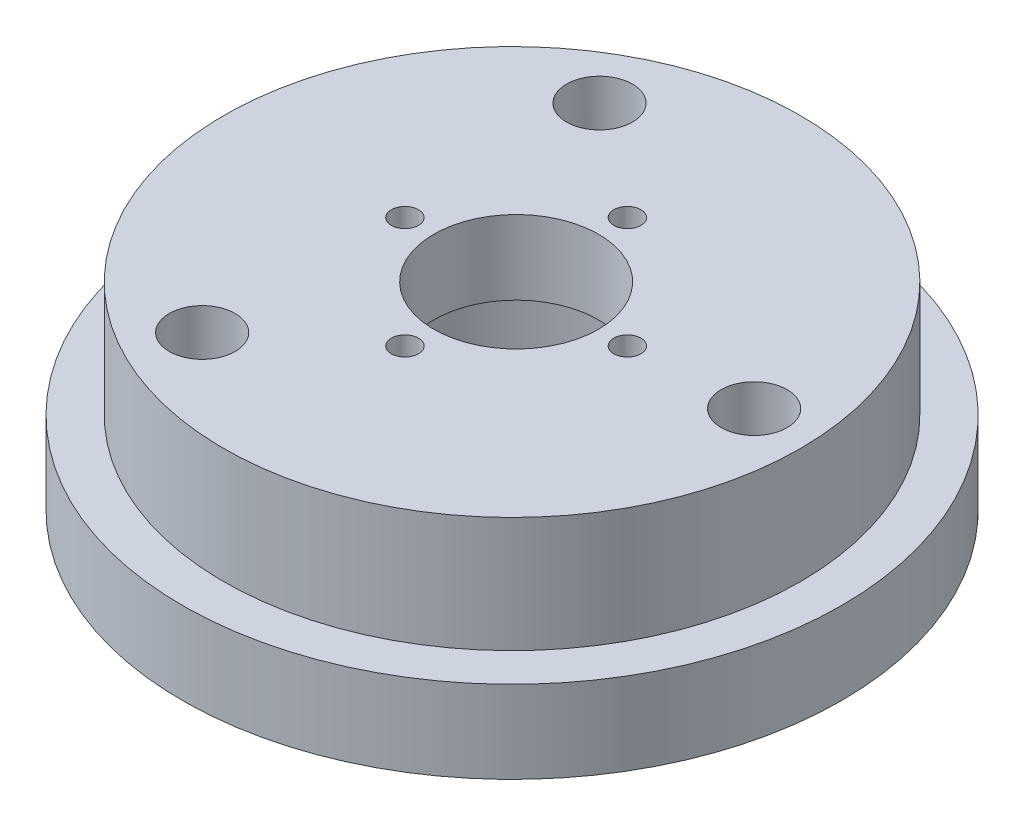
ISO-10303-21;
HEADER;
FILE_DESCRIPTION(('STEP AP214'),'2;1');
FILE_NAME('part.step','',(''),(''),'','','');
FILE_SCHEMA(('AUTOMOTIVE_DESIGN { 1 0 10303 214 1 1 1 1 }'));
ENDSEC;
DATA;
#1=APPLICATION_CONTEXT('core data for automotive mechanical design processes');
#2=APPLICATION_PROTOCOL_DEFINITION('international standard','automotive_design',2000,#1);
#3=PRODUCT_CONTEXT('',#1,'mechanical');
#4=PRODUCT('Part','Part','',(#3));
#5=PRODUCT_RELATED_PRODUCT_CATEGORY('part','',(#4));
#6=PRODUCT_DEFINITION_FORMATION('','',#4);
#7=PRODUCT_DEFINITION_CONTEXT('part definition',#1,'design');
#8=PRODUCT_DEFINITION('design','',#6,#7);
#9=PRODUCT_DEFINITION_SHAPE('','',#8);
#10=(LENGTH_UNIT() NAMED_UNIT(*) SI_UNIT(.MILLI.,.METRE.));
#11=(NAMED_UNIT(*) PLANE_ANGLE_UNIT() SI_UNIT($,.RADIAN.));
#12=(NAMED_UNIT(*) SI_UNIT($,.STERADIAN.) SOLID_ANGLE_UNIT());
#13=UNCERTAINTY_MEASURE_WITH_UNIT(LENGTH_MEASURE(1.E-05),#10,'distance_accuracy_value','');
#14=(GEOMETRIC_REPRESENTATION_CONTEXT(3) GLOBAL_UNCERTAINTY_ASSIGNED_CONTEXT((#13)) GLOBAL_UNIT_ASSIGNED_CONTEXT((#10,
#11,#12)) REPRESENTATION_CONTEXT('',''));
#15=CARTESIAN_POINT('',(0.,0.,0.));
#16=DIRECTION('',(0.,0.,1.));
#17=DIRECTION('',(1.,0.,0.));
#18=AXIS2_PLACEMENT_3D('',#15,#16,#17);
#19=CARTESIAN_POINT('',(0.220332098414475,24.0000000000005,-0.275415123018152));
#20=DIRECTION('',(0.,-1.,0.));
#21=DIRECTION('',(1.,0.,0.));
#22=AXIS2_PLACEMENT_3D('',#19,#20,#21);
#23=CYLINDRICAL_SURFACE('',#22,10.);
#24=CARTESIAN_POINT('',(0.220332098414475,24.0000000000005,-0.275415123018152));
#25=DIRECTION('',(0.,-1.,0.));
#26=DIRECTION('',(1.,0.,0.));
#27=AXIS2_PLACEMENT_3D('',#24,#25,#26);
#28=CIRCLE('',#27,10.);
#29=CARTESIAN_POINT('',(10.2203320984145,24.0000000000005,-0.275415123018152));
#30=VERTEX_POINT('',#29);
#31=EDGE_CURVE('E86',#30,#30,#28,.T.);
#32=ORIENTED_EDGE('',*,*,#31,.F.);
#33=EDGE_LOOP('',(#32));
#34=FACE_BOUND('',#33,.T.);
#35=CARTESIAN_POINT('',(0.220332098414506,15.,-0.275415123018152));
#36=DIRECTION('',(0.,-1.,0.));
#37=DIRECTION('',(1.,0.,0.));
#38=AXIS2_PLACEMENT_3D('',#35,#36,#37);
#39=CIRCLE('',#38,10.);
#40=CARTESIAN_POINT('',(10.2203320984145,15.,-0.275415123018152));
#41=VERTEX_POINT('',#40);
#42=EDGE_CURVE('E124',#41,#41,#39,.T.);
#43=ORIENTED_EDGE('',*,*,#42,.T.);
#44=EDGE_LOOP('',(#43));
#45=FACE_BOUND('',#44,.T.);
#46=ADVANCED_FACE('F36',(#34,#45),#23,.F.);
#47=CARTESIAN_POINT('',(0.220332098414475,24.0000000000005,13.2245848769818));
#48=DIRECTION('',(0.,-1.,0.));
#49=DIRECTION('',(1.,0.,0.));
#50=AXIS2_PLACEMENT_3D('',#47,#48,#49);
#51=CYLINDRICAL_SURFACE('',#50,1.65);
#52=CARTESIAN_POINT('',(0.220332098414475,24.0000000000005,13.2245848769818));
#53=DIRECTION('',(0.,-1.,0.));
#54=DIRECTION('',(1.,0.,0.));
#55=AXIS2_PLACEMENT_3D('',#52,#53,#54);
#56=CIRCLE('',#55,1.65);
#57=CARTESIAN_POINT('',(1.87033209841448,24.0000000000005,13.2245848769818));
#58=VERTEX_POINT('',#57);
#59=EDGE_CURVE('E80',#58,#58,#56,.F.);
#60=ORIENTED_EDGE('',*,*,#59,.T.);
#61=EDGE_LOOP('',(#60));
#62=FACE_BOUND('',#61,.T.);
#63=CARTESIAN_POINT('',(0.220332098414506,15.,13.2245848769818));
#64=DIRECTION('',(0.,-1.,0.));
#65=DIRECTION('',(1.,0.,0.));
#66=AXIS2_PLACEMENT_3D('',#63,#64,#65);
#67=CIRCLE('',#66,1.65);
#68=CARTESIAN_POINT('',(1.87033209841451,15.,13.2245848769818));
#69=VERTEX_POINT('',#68);
#70=EDGE_CURVE('E74',#69,#69,#67,.F.);
#71=ORIENTED_EDGE('',*,*,#70,.F.);
#72=EDGE_LOOP('',(#71));
#73=FACE_BOUND('',#72,.T.);
#74=ADVANCED_FACE('F118',(#62,#73),#51,.F.);
#75=CARTESIAN_POINT('',(-13.2796679015855,24.0000000000005,-0.275415123018152));
#76=DIRECTION('',(0.,-1.,0.));
#77=DIRECTION('',(1.,0.,0.));
#78=AXIS2_PLACEMENT_3D('',#75,#76,#77);
#79=CYLINDRICAL_SURFACE('',#78,1.65);
#80=CARTESIAN_POINT('',(-13.2796679015855,24.0000000000005,-0.275415123018152));
#81=DIRECTION('',(0.,-1.,0.));
#82=DIRECTION('',(1.,0.,0.));
#83=AXIS2_PLACEMENT_3D('',#80,#81,#82);
#84=CIRCLE('',#83,1.65);
#85=CARTESIAN_POINT('',(-11.6296679015855,24.0000000000005,-0.275415123018152));
#86=VERTEX_POINT('',#85);
#87=EDGE_CURVE('E76',#86,#86,#84,.F.);
#88=ORIENTED_EDGE('',*,*,#87,.T.);
#89=EDGE_LOOP('',(#88));
#90=FACE_BOUND('',#89,.T.);
#91=CARTESIAN_POINT('',(-13.2796679015855,15.,-0.275415123018152));
#92=DIRECTION('',(0.,-1.,0.));
#93=DIRECTION('',(1.,0.,0.));
#94=AXIS2_PLACEMENT_3D('',#91,#92,#93);
#95=CIRCLE('',#94,1.65);
#96=CARTESIAN_POINT('',(-11.6296679015855,15.,-0.275415123018152));
#97=VERTEX_POINT('',#96);
#98=EDGE_CURVE('E122',#97,#97,#95,.F.);
#99=ORIENTED_EDGE('',*,*,#98,.F.);
#100=EDGE_LOOP('',(#99));
#101=FACE_BOUND('',#100,.T.);
#102=ADVANCED_FACE('F114',(#90,#101),#79,.F.);
#103=CARTESIAN_POINT('',(0.220332098414475,24.0000000000005,-13.7754151230182));
#104=DIRECTION('',(0.,-1.,0.));
#105=DIRECTION('',(1.,0.,0.));
#106=AXIS2_PLACEMENT_3D('',#103,#104,#105);
#107=CYLINDRICAL_SURFACE('',#106,1.65);
#108=CARTESIAN_POINT('',(0.220332098414475,24.0000000000005,-13.7754151230182));
#109=DIRECTION('',(0.,-1.,0.));
#110=DIRECTION('',(1.,0.,0.));
#111=AXIS2_PLACEMENT_3D('',#108,#109,#110);
#112=CIRCLE('',#111,1.65);
#113=CARTESIAN_POINT('',(1.87033209841448,24.0000000000005,-13.7754151230182));
#114=VERTEX_POINT('',#113);
#115=EDGE_CURVE('E79',#114,#114,#112,.T.);
#116=ORIENTED_EDGE('',*,*,#115,.F.);
#117=EDGE_LOOP('',(#116));
#118=FACE_BOUND('',#117,.T.);
#119=CARTESIAN_POINT('',(0.220332098414506,15.,-13.7754151230182));
#120=DIRECTION('',(0.,-1.,0.));
#121=DIRECTION('',(1.,0.,0.));
#122=AXIS2_PLACEMENT_3D('',#119,#120,#121);
#123=CIRCLE('',#122,1.65);
#124=CARTESIAN_POINT('',(1.87033209841451,15.,-13.7754151230182));
#125=VERTEX_POINT('',#124);
#126=EDGE_CURVE('E65',#125,#125,#123,.T.);
#127=ORIENTED_EDGE('',*,*,#126,.T.);
#128=EDGE_LOOP('',(#127));
#129=FACE_BOUND('',#128,.T.);
#130=ADVANCED_FACE('F117',(#118,#129),#107,.F.);
#131=CARTESIAN_POINT('',(13.7203320984145,24.0000000000006,-0.275415123018152));
#132=DIRECTION('',(0.,-1.,0.));
#133=DIRECTION('',(1.,0.,0.));
#134=AXIS2_PLACEMENT_3D('',#131,#132,#133);
#135=CYLINDRICAL_SURFACE('',#134,1.65);
#136=CARTESIAN_POINT('',(13.7203320984145,24.0000000000006,-0.275415123018152));
#137=DIRECTION('',(0.,-1.,0.));
#138=DIRECTION('',(1.,0.,0.));
#139=AXIS2_PLACEMENT_3D('',#136,#137,#138);
#140=CIRCLE('',#139,1.65);
#141=CARTESIAN_POINT('',(15.3703320984145,24.0000000000006,-0.275415123018152));
#142=VERTEX_POINT('',#141);
#143=EDGE_CURVE('E83',#142,#142,#140,.T.);
#144=ORIENTED_EDGE('',*,*,#143,.F.);
#145=EDGE_LOOP('',(#144));
#146=FACE_BOUND('',#145,.T.);
#147=CARTESIAN_POINT('',(13.7203320984145,15.,-0.275415123018152));
#148=DIRECTION('',(0.,-1.,0.));
#149=DIRECTION('',(1.,0.,0.));
#150=AXIS2_PLACEMENT_3D('',#147,#148,#149);
#151=CIRCLE('',#150,1.65);
#152=CARTESIAN_POINT('',(15.3703320984145,15.0000000000001,-0.275415123018152));
#153=VERTEX_POINT('',#152);
#154=EDGE_CURVE('E127',#153,#153,#151,.T.);
#155=ORIENTED_EDGE('',*,*,#154,.T.);
#156=EDGE_LOOP('',(#155));
#157=FACE_BOUND('',#156,.T.);
#158=ADVANCED_FACE('F254',(#146,#157),#135,.F.);
#159=CARTESIAN_POINT('',(0.,0.,0.));
#160=DIRECTION('',(0.,1.,0.));
#161=DIRECTION('',(-1.,0.,0.));
#162=AXIS2_PLACEMENT_3D('',#159,#160,#161);
#163=PLANE('',#162);
#164=CARTESIAN_POINT('',(28.,0.,-1.38205023608726));
#165=DIRECTION('',(0.,1.,0.));
#166=DIRECTION('',(-1.,0.,0.));
#167=AXIS2_PLACEMENT_3D('',#164,#165,#166);
#168=CIRCLE('',#167,4.00000000000001);
#169=CARTESIAN_POINT('',(24.,0.,-1.38205023608726));
#170=VERTEX_POINT('',#169);
#171=EDGE_CURVE('E56',#170,#170,#168,.T.);
#172=ORIENTED_EDGE('',*,*,#171,.T.);
#173=EDGE_LOOP('',(#172));
#174=FACE_BOUND('',#173,.T.);
#175=CARTESIAN_POINT('',(-13.5,-1.14491749414469E-13,24.11));
#176=DIRECTION('',(0.,1.,0.));
#177=DIRECTION('',(-1.,0.,0.));
#178=AXIS2_PLACEMENT_3D('',#175,#176,#177);
#179=CIRCLE('',#178,4.);
#180=CARTESIAN_POINT('',(-17.5,-1.28212745410012E-13,24.11));
#181=VERTEX_POINT('',#180);
#182=EDGE_CURVE('E137',#181,#181,#179,.T.);
#183=ORIENTED_EDGE('',*,*,#182,.T.);
#184=EDGE_LOOP('',(#183));
#185=FACE_BOUND('',#184,.T.);
#186=CARTESIAN_POINT('',(-13.4999999999997,-1.14491749414469E-13,-24.1147367102514));
#187=DIRECTION('',(0.,1.,0.));
#188=DIRECTION('',(-1.,0.,0.));
#189=AXIS2_PLACEMENT_3D('',#186,#187,#188);
#190=CIRCLE('',#189,4.);
#191=CARTESIAN_POINT('',(-17.4999999999997,-1.28212745410012E-13,-24.1147367102514));
#192=VERTEX_POINT('',#191);
#193=EDGE_CURVE('E134',#192,#192,#190,.T.);
#194=ORIENTED_EDGE('',*,*,#193,.T.);
#195=EDGE_LOOP('',(#194));
#196=FACE_BOUND('',#195,.T.);
#197=CARTESIAN_POINT('',(0.220332098414557,0.,-0.275415123018152));
#198=DIRECTION('',(0.,-1.,0.));
#199=DIRECTION('',(1.,0.,0.));
#200=AXIS2_PLACEMENT_3D('',#197,#198,#199);
#201=CIRCLE('',#200,20.);
#202=CARTESIAN_POINT('',(20.2203320984146,0.,-0.275415123018152));
#203=VERTEX_POINT('',#202);
#204=EDGE_CURVE('E61',#203,#203,#201,.T.);
#205=ORIENTED_EDGE('',*,*,#204,.F.);
#206=EDGE_LOOP('',(#205));
#207=FACE_BOUND('',#206,.T.);
#208=CARTESIAN_POINT('',(0.,2.22044604925031E-13,0.));
#209=DIRECTION('',(0.,-1.,0.));
#210=DIRECTION('',(1.,0.,0.));
#211=AXIS2_PLACEMENT_3D('',#208,#209,#210);
#212=CIRCLE('',#211,40.);
#213=CARTESIAN_POINT('',(40.,3.59254564880462E-13,0.));
#214=VERTEX_POINT('',#213);
#215=EDGE_CURVE('E10',#214,#214,#212,.T.);
#216=ORIENTED_EDGE('',*,*,#215,.T.);
#217=EDGE_LOOP('',(#216));
#218=FACE_BOUND('',#217,.T.);
#219=ADVANCED_FACE('F38',(#174,#185,#196,#207,#218),#163,.F.);
#220=CARTESIAN_POINT('',(-35.,23.9999999999999,0.));
#221=DIRECTION('',(0.,-1.,0.));
#222=DIRECTION('',(1.,0.,0.));
#223=AXIS2_PLACEMENT_3D('',#220,#221,#222);
#224=PLANE('',#223);
#225=CARTESIAN_POINT('',(27.9999999999999,24.0000000000002,-1.38205023608726));
#226=DIRECTION('',(0.,-1.,0.));
#227=DIRECTION('',(1.,0.,0.));
#228=AXIS2_PLACEMENT_3D('',#225,#226,#227);
#229=CIRCLE('',#228,4.00000000000001);
#230=CARTESIAN_POINT('',(31.9999999999999,24.0000000000002,-1.38205023608726));
#231=VERTEX_POINT('',#230);
#232=EDGE_CURVE('E40',#231,#231,#229,.T.);
#233=ORIENTED_EDGE('',*,*,#232,.T.);
#234=EDGE_LOOP('',(#233));
#235=FACE_BOUND('',#234,.T.);
#236=CARTESIAN_POINT('',(-13.5000000000001,24.,24.11));
#237=DIRECTION('',(0.,-1.,0.));
#238=DIRECTION('',(1.,0.,0.));
#239=AXIS2_PLACEMENT_3D('',#236,#237,#238);
#240=CIRCLE('',#239,4.);
#241=CARTESIAN_POINT('',(-9.50000000000009,24.,24.11));
#242=VERTEX_POINT('',#241);
#243=EDGE_CURVE('E55',#242,#242,#240,.T.);
#244=ORIENTED_EDGE('',*,*,#243,.T.);
#245=EDGE_LOOP('',(#244));
#246=FACE_BOUND('',#245,.T.);
#247=CARTESIAN_POINT('',(-13.4999999999998,24.,-24.1147367102514));
#248=DIRECTION('',(0.,-1.,0.));
#249=DIRECTION('',(1.,0.,0.));
#250=AXIS2_PLACEMENT_3D('',#247,#248,#249);
#251=CIRCLE('',#250,4.);
#252=CARTESIAN_POINT('',(-9.49999999999975,24.,-24.1147367102514));
#253=VERTEX_POINT('',#252);
#254=EDGE_CURVE('E53',#253,#253,#251,.T.);
#255=ORIENTED_EDGE('',*,*,#254,.T.);
#256=EDGE_LOOP('',(#255));
#257=FACE_BOUND('',#256,.T.);
#258=ORIENTED_EDGE('',*,*,#143,.T.);
#259=EDGE_LOOP('',(#258));
#260=FACE_BOUND('',#259,.T.);
#261=ORIENTED_EDGE('',*,*,#115,.T.);
#262=EDGE_LOOP('',(#261));
#263=FACE_BOUND('',#262,.T.);
#264=ORIENTED_EDGE('',*,*,#31,.T.);
#265=EDGE_LOOP('',(#264));
#266=FACE_BOUND('',#265,.T.);
#267=CARTESIAN_POINT('',(0.,24.0000000000002,0.));
#268=DIRECTION('',(0.,-1.,0.));
#269=DIRECTION('',(1.,0.,0.));
#270=AXIS2_PLACEMENT_3D('',#267,#268,#269);
#271=CIRCLE('',#270,34.9999999999999);
#272=CARTESIAN_POINT('',(34.9999999999998,24.0000000000004,0.));
#273=VERTEX_POINT('',#272);
#274=EDGE_CURVE('E91',#273,#273,#271,.T.);
#275=ORIENTED_EDGE('',*,*,#274,.F.);
#276=EDGE_LOOP('',(#275));
#277=FACE_BOUND('',#276,.T.);
#278=ORIENTED_EDGE('',*,*,#59,.F.);
#279=EDGE_LOOP('',(#278));
#280=FACE_BOUND('',#279,.T.);
#281=ORIENTED_EDGE('',*,*,#87,.F.);
#282=EDGE_LOOP('',(#281));
#283=FACE_BOUND('',#282,.T.);
#284=ADVANCED_FACE('F105',(#235,#246,#257,#260,#263,#266,#277,#280,#283),#224,.F.);
#285=CARTESIAN_POINT('',(3.43024899888577E-12,-1000.,0.));
#286=DIRECTION('',(0.,-1.,0.));
#287=DIRECTION('',(1.,0.,0.));
#288=AXIS2_PLACEMENT_3D('',#285,#286,#287);
#289=CYLINDRICAL_SURFACE('',#288,40.);
#290=ORIENTED_EDGE('',*,*,#215,.F.);
#291=EDGE_LOOP('',(#290));
#292=FACE_BOUND('',#291,.T.);
#293=CARTESIAN_POINT('',(0.,10.0000000000002,0.));
#294=DIRECTION('',(0.,-1.,0.));
#295=DIRECTION('',(1.,0.,0.));
#296=AXIS2_PLACEMENT_3D('',#293,#294,#295);
#297=CIRCLE('',#296,40.);
#298=CARTESIAN_POINT('',(39.9999999999999,10.0000000000004,0.));
#299=VERTEX_POINT('',#298);
#300=EDGE_CURVE('E44',#299,#299,#297,.T.);
#301=ORIENTED_EDGE('',*,*,#300,.T.);
#302=EDGE_LOOP('',(#301));
#303=FACE_BOUND('',#302,.T.);
#304=ADVANCED_FACE('F108',(#292,#303),#289,.T.);
#305=CARTESIAN_POINT('',(-40.,9.99999999999999,0.));
#306=DIRECTION('',(0.,-1.,0.));
#307=DIRECTION('',(1.,0.,0.));
#308=AXIS2_PLACEMENT_3D('',#305,#306,#307);
#309=PLANE('',#308);
#310=ORIENTED_EDGE('',*,*,#300,.F.);
#311=EDGE_LOOP('',(#310));
#312=FACE_BOUND('',#311,.T.);
#313=CARTESIAN_POINT('',(0.,10.0000000000002,0.));
#314=DIRECTION('',(0.,-1.,0.));
#315=DIRECTION('',(1.,0.,0.));
#316=AXIS2_PLACEMENT_3D('',#313,#314,#315);
#317=CIRCLE('',#316,35.);
#318=CARTESIAN_POINT('',(34.9999999999999,10.0000000000003,0.));
#319=VERTEX_POINT('',#318);
#320=EDGE_CURVE('E49',#319,#319,#317,.T.);
#321=ORIENTED_EDGE('',*,*,#320,.T.);
#322=EDGE_LOOP('',(#321));
#323=FACE_BOUND('',#322,.T.);
#324=ADVANCED_FACE('F96',(#312,#323),#309,.F.);
#325=CARTESIAN_POINT('',(3.43024899888577E-12,-1000.,0.));
#326=DIRECTION('',(0.,-1.,0.));
#327=DIRECTION('',(1.,0.,0.));
#328=AXIS2_PLACEMENT_3D('',#325,#326,#327);
#329=CYLINDRICAL_SURFACE('',#328,35.);
#330=ORIENTED_EDGE('',*,*,#320,.F.);
#331=EDGE_LOOP('',(#330));
#332=FACE_BOUND('',#331,.T.);
#333=ORIENTED_EDGE('',*,*,#274,.T.);
#334=EDGE_LOOP('',(#333));
#335=FACE_BOUND('',#334,.T.);
#336=ADVANCED_FACE('F98',(#332,#335),#329,.T.);
#337=CARTESIAN_POINT('',(0.220332098414506,15.,-0.275415123018152));
#338=DIRECTION('',(0.,-1.,0.));
#339=DIRECTION('',(1.,0.,0.));
#340=AXIS2_PLACEMENT_3D('',#337,#338,#339);
#341=CYLINDRICAL_SURFACE('',#340,20.);
#342=CARTESIAN_POINT('',(0.220332098414506,15.,-0.275415123018152));
#343=DIRECTION('',(0.,-1.,0.));
#344=DIRECTION('',(1.,0.,0.));
#345=AXIS2_PLACEMENT_3D('',#342,#343,#344);
#346=CIRCLE('',#345,20.);
#347=CARTESIAN_POINT('',(20.2203320984145,15.0000000000001,-0.275415123018152));
#348=VERTEX_POINT('',#347);
#349=EDGE_CURVE('E70',#348,#348,#346,.T.);
#350=ORIENTED_EDGE('',*,*,#349,.F.);
#351=EDGE_LOOP('',(#350));
#352=FACE_BOUND('',#351,.T.);
#353=ORIENTED_EDGE('',*,*,#204,.T.);
#354=EDGE_LOOP('',(#353));
#355=FACE_BOUND('',#354,.T.);
#356=ADVANCED_FACE('F101',(#352,#355),#341,.F.);
#357=CARTESIAN_POINT('',(0.,15.,0.));
#358=DIRECTION('',(0.,-1.,0.));
#359=DIRECTION('',(1.,0.,0.));
#360=AXIS2_PLACEMENT_3D('',#357,#358,#359);
#361=PLANE('',#360);
#362=ORIENTED_EDGE('',*,*,#126,.F.);
#363=EDGE_LOOP('',(#362));
#364=FACE_BOUND('',#363,.T.);
#365=ORIENTED_EDGE('',*,*,#349,.T.);
#366=EDGE_LOOP('',(#365));
#367=FACE_BOUND('',#366,.T.);
#368=ORIENTED_EDGE('',*,*,#154,.F.);
#369=EDGE_LOOP('',(#368));
#370=FACE_BOUND('',#369,.T.);
#371=ORIENTED_EDGE('',*,*,#42,.F.);
#372=EDGE_LOOP('',(#371));
#373=FACE_BOUND('',#372,.T.);
#374=ORIENTED_EDGE('',*,*,#98,.T.);
#375=EDGE_LOOP('',(#374));
#376=FACE_BOUND('',#375,.T.);
#377=ORIENTED_EDGE('',*,*,#70,.T.);
#378=EDGE_LOOP('',(#377));
#379=FACE_BOUND('',#378,.T.);
#380=ADVANCED_FACE('F187',(#364,#367,#370,#373,#376,#379),#361,.T.);
#381=CARTESIAN_POINT('',(-13.4999999999997,-1.14491749414469E-13,-24.1147367102514));
#382=DIRECTION('',(0.,1.,0.));
#383=DIRECTION('',(-1.,0.,0.));
#384=AXIS2_PLACEMENT_3D('',#381,#382,#383);
#385=CYLINDRICAL_SURFACE('',#384,4.);
#386=ORIENTED_EDGE('',*,*,#193,.F.);
#387=EDGE_LOOP('',(#386));
#388=FACE_BOUND('',#387,.T.);
#389=ORIENTED_EDGE('',*,*,#254,.F.);
#390=EDGE_LOOP('',(#389));
#391=FACE_BOUND('',#390,.T.);
#392=ADVANCED_FACE('F152',(#388,#391),#385,.F.);
#393=CARTESIAN_POINT('',(-13.5,-1.14491749414469E-13,24.11));
#394=DIRECTION('',(0.,1.,0.));
#395=DIRECTION('',(-1.,0.,0.));
#396=AXIS2_PLACEMENT_3D('',#393,#394,#395);
#397=CYLINDRICAL_SURFACE('',#396,4.);
#398=ORIENTED_EDGE('',*,*,#182,.F.);
#399=EDGE_LOOP('',(#398));
#400=FACE_BOUND('',#399,.T.);
#401=ORIENTED_EDGE('',*,*,#243,.F.);
#402=EDGE_LOOP('',(#401));
#403=FACE_BOUND('',#402,.T.);
#404=ADVANCED_FACE('F148',(#400,#403),#397,.F.);
#405=CARTESIAN_POINT('',(28.,0.,-1.38205023608726));
#406=DIRECTION('',(0.,1.,0.));
#407=DIRECTION('',(-1.,0.,0.));
#408=AXIS2_PLACEMENT_3D('',#405,#406,#407);
#409=CYLINDRICAL_SURFACE('',#408,4.00000000000001);
#410=ORIENTED_EDGE('',*,*,#171,.F.);
#411=EDGE_LOOP('',(#410));
#412=FACE_BOUND('',#411,.T.);
#413=ORIENTED_EDGE('',*,*,#232,.F.);
#414=EDGE_LOOP('',(#413));
#415=FACE_BOUND('',#414,.T.);
#416=ADVANCED_FACE('F145',(#412,#415),#409,.F.);
#417=CLOSED_SHELL('',(#46,#74,#102,#130,#158,#219,#284,#304,#324,#336,#356,#380,#392,#404,#416));
#418=MANIFOLD_SOLID_BREP('B2',#417);
#419=ADVANCED_BREP_SHAPE_REPRESENTATION('',(#18,#418),#14);
#420=SHAPE_DEFINITION_REPRESENTATION(#9,#419);
ENDSEC;
END-ISO-10303-21;
